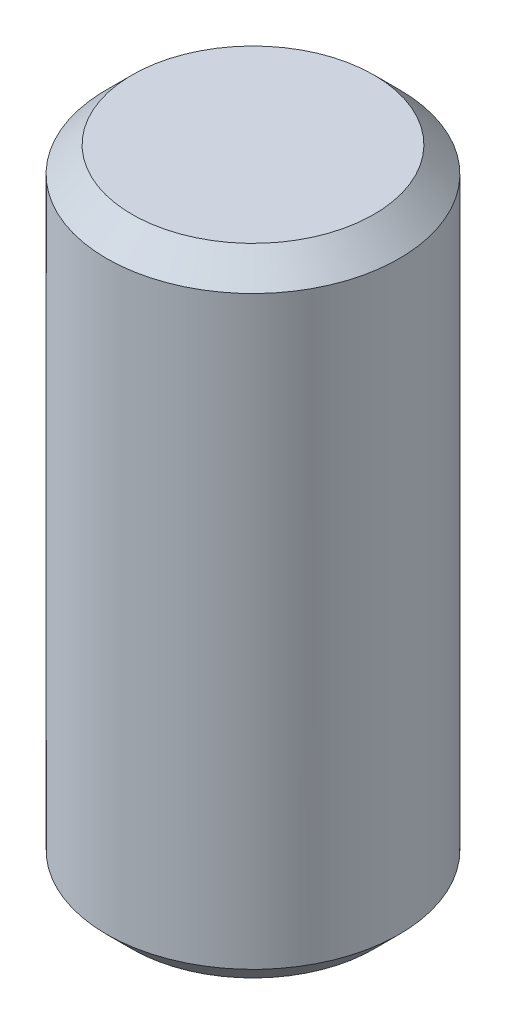
ISO-10303-21;
HEADER;
FILE_DESCRIPTION(('STEP AP214'),'2;1');
FILE_NAME('part.step','',(''),(''),'','','');
FILE_SCHEMA(('AUTOMOTIVE_DESIGN { 1 0 10303 214 1 1 1 1 }'));
ENDSEC;
DATA;
#1=APPLICATION_CONTEXT('core data for automotive mechanical design processes');
#2=APPLICATION_PROTOCOL_DEFINITION('international standard','automotive_design',2000,#1);
#3=PRODUCT_CONTEXT('',#1,'mechanical');
#4=PRODUCT('Part','Part','',(#3));
#5=PRODUCT_RELATED_PRODUCT_CATEGORY('part','',(#4));
#6=PRODUCT_DEFINITION_FORMATION('','',#4);
#7=PRODUCT_DEFINITION_CONTEXT('part definition',#1,'design');
#8=PRODUCT_DEFINITION('design','',#6,#7);
#9=PRODUCT_DEFINITION_SHAPE('','',#8);
#10=(LENGTH_UNIT() NAMED_UNIT(*) SI_UNIT(.MILLI.,.METRE.));
#11=(NAMED_UNIT(*) PLANE_ANGLE_UNIT() SI_UNIT($,.RADIAN.));
#12=(NAMED_UNIT(*) SI_UNIT($,.STERADIAN.) SOLID_ANGLE_UNIT());
#13=UNCERTAINTY_MEASURE_WITH_UNIT(LENGTH_MEASURE(1.E-05),#10,'distance_accuracy_value','');
#14=(GEOMETRIC_REPRESENTATION_CONTEXT(3) GLOBAL_UNCERTAINTY_ASSIGNED_CONTEXT((#13)) GLOBAL_UNIT_ASSIGNED_CONTEXT((#10,
#11,#12)) REPRESENTATION_CONTEXT('',''));
#15=CARTESIAN_POINT('',(0.,0.,0.));
#16=DIRECTION('',(0.,0.,1.));
#17=DIRECTION('',(1.,0.,0.));
#18=AXIS2_PLACEMENT_3D('',#15,#16,#17);
#19=CARTESIAN_POINT('',(0.,-6.35,0.));
#20=DIRECTION('',(0.,1.,0.));
#21=DIRECTION('',(0.,0.,1.));
#22=AXIS2_PLACEMENT_3D('',#19,#20,#21);
#23=PLANE('',#22);
#24=CARTESIAN_POINT('',(0.,-6.35,0.));
#25=DIRECTION('',(0.,1.,0.));
#26=DIRECTION('',(0.,0.,1.));
#27=AXIS2_PLACEMENT_3D('',#24,#25,#26);
#28=CIRCLE('',#27,2.413);
#29=CARTESIAN_POINT('',(0.,-6.35,2.413));
#30=VERTEX_POINT('',#29);
#31=EDGE_CURVE('E37',#30,#30,#28,.F.);
#32=ORIENTED_EDGE('',*,*,#31,.T.);
#33=EDGE_LOOP('',(#32));
#34=FACE_BOUND('',#33,.T.);
#35=ADVANCED_FACE('F30',(#34),#23,.F.);
#36=CARTESIAN_POINT('',(0.,6.08020788678209,0.));
#37=DIRECTION('',(0.,1.,0.));
#38=DIRECTION('',(0.,0.,1.));
#39=AXIS2_PLACEMENT_3D('',#36,#37,#38);
#40=CYLINDRICAL_SURFACE('',#39,2.921);
#41=CARTESIAN_POINT('',(0.,-5.842,0.));
#42=DIRECTION('',(0.,1.,0.));
#43=DIRECTION('',(0.,0.,1.));
#44=AXIS2_PLACEMENT_3D('',#41,#42,#43);
#45=CIRCLE('',#44,2.921);
#46=CARTESIAN_POINT('',(0.,-5.842,2.921));
#47=VERTEX_POINT('',#46);
#48=EDGE_CURVE('E41',#47,#47,#45,.T.);
#49=ORIENTED_EDGE('',*,*,#48,.T.);
#50=EDGE_LOOP('',(#49));
#51=FACE_BOUND('',#50,.T.);
#52=CARTESIAN_POINT('',(0.,5.842,0.));
#53=DIRECTION('',(0.,-1.,0.));
#54=DIRECTION('',(0.,0.,-1.));
#55=AXIS2_PLACEMENT_3D('',#52,#53,#54);
#56=CIRCLE('',#55,2.921);
#57=CARTESIAN_POINT('',(0.,5.842,-2.921));
#58=VERTEX_POINT('',#57);
#59=EDGE_CURVE('E45',#58,#58,#56,.T.);
#60=ORIENTED_EDGE('',*,*,#59,.T.);
#61=EDGE_LOOP('',(#60));
#62=FACE_BOUND('',#61,.T.);
#63=ADVANCED_FACE('F51',(#51,#62),#40,.T.);
#64=CARTESIAN_POINT('',(2.921,6.35,0.));
#65=DIRECTION('',(0.,-1.,0.));
#66=DIRECTION('',(0.,0.,-1.));
#67=AXIS2_PLACEMENT_3D('',#64,#65,#66);
#68=PLANE('',#67);
#69=CARTESIAN_POINT('',(0.,6.35,0.));
#70=DIRECTION('',(0.,-1.,0.));
#71=DIRECTION('',(0.,0.,-1.));
#72=AXIS2_PLACEMENT_3D('',#69,#70,#71);
#73=CIRCLE('',#72,2.413);
#74=CARTESIAN_POINT('',(0.,6.35,-2.413));
#75=VERTEX_POINT('',#74);
#76=EDGE_CURVE('E10',#75,#75,#73,.F.);
#77=ORIENTED_EDGE('',*,*,#76,.T.);
#78=EDGE_LOOP('',(#77));
#79=FACE_BOUND('',#78,.T.);
#80=ADVANCED_FACE('F59',(#79),#68,.F.);
#81=CARTESIAN_POINT('',(0.,-5.842,0.));
#82=DIRECTION('',(0.,1.,0.));
#83=DIRECTION('',(0.,0.,1.));
#84=AXIS2_PLACEMENT_3D('',#81,#82,#83);
#85=CONICAL_SURFACE('',#84,2.921,0.785398163397452);
#86=ORIENTED_EDGE('',*,*,#31,.F.);
#87=EDGE_LOOP('',(#86));
#88=FACE_BOUND('',#87,.T.);
#89=ORIENTED_EDGE('',*,*,#48,.F.);
#90=EDGE_LOOP('',(#89));
#91=FACE_BOUND('',#90,.T.);
#92=ADVANCED_FACE('F55',(#88,#91),#85,.T.);
#93=CARTESIAN_POINT('',(0.,6.35,0.));
#94=DIRECTION('',(0.,-1.,0.));
#95=DIRECTION('',(0.,0.,-1.));
#96=AXIS2_PLACEMENT_3D('',#93,#94,#95);
#97=CONICAL_SURFACE('',#96,2.413,0.785398163397447);
#98=ORIENTED_EDGE('',*,*,#59,.F.);
#99=EDGE_LOOP('',(#98));
#100=FACE_BOUND('',#99,.T.);
#101=ORIENTED_EDGE('',*,*,#76,.F.);
#102=EDGE_LOOP('',(#101));
#103=FACE_BOUND('',#102,.T.);
#104=ADVANCED_FACE('F32',(#100,#103),#97,.T.);
#105=CLOSED_SHELL('',(#35,#63,#80,#92,#104));
#106=MANIFOLD_SOLID_BREP('B2',#105);
#107=ADVANCED_BREP_SHAPE_REPRESENTATION('',(#18,#106),#14);
#108=SHAPE_DEFINITION_REPRESENTATION(#9,#107);
ENDSEC;
END-ISO-10303-21;
